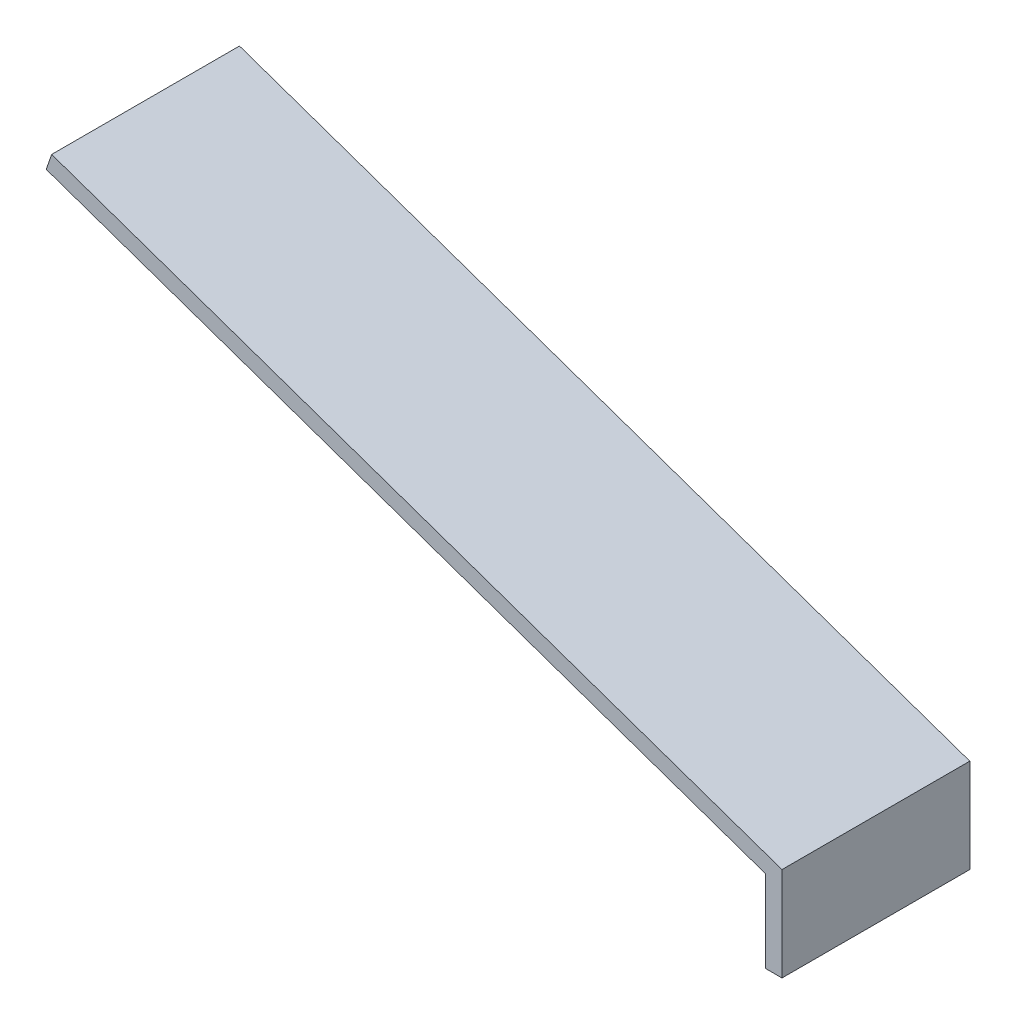
ISO-10303-21;
HEADER;
FILE_DESCRIPTION(('STEP AP214'),'2;1');
FILE_NAME('part.step','',(''),(''),'','','');
FILE_SCHEMA(('AUTOMOTIVE_DESIGN { 1 0 10303 214 1 1 1 1 }'));
ENDSEC;
DATA;
#1=APPLICATION_CONTEXT('core data for automotive mechanical design processes');
#2=APPLICATION_PROTOCOL_DEFINITION('international standard','automotive_design',2000,#1);
#3=PRODUCT_CONTEXT('',#1,'mechanical');
#4=PRODUCT('Part','Part','',(#3));
#5=PRODUCT_RELATED_PRODUCT_CATEGORY('part','',(#4));
#6=PRODUCT_DEFINITION_FORMATION('','',#4);
#7=PRODUCT_DEFINITION_CONTEXT('part definition',#1,'design');
#8=PRODUCT_DEFINITION('design','',#6,#7);
#9=PRODUCT_DEFINITION_SHAPE('','',#8);
#10=(LENGTH_UNIT() NAMED_UNIT(*) SI_UNIT(.MILLI.,.METRE.));
#11=(NAMED_UNIT(*) PLANE_ANGLE_UNIT() SI_UNIT($,.RADIAN.));
#12=(NAMED_UNIT(*) SI_UNIT($,.STERADIAN.) SOLID_ANGLE_UNIT());
#13=UNCERTAINTY_MEASURE_WITH_UNIT(LENGTH_MEASURE(1.E-05),#10,'distance_accuracy_value','');
#14=(GEOMETRIC_REPRESENTATION_CONTEXT(3) GLOBAL_UNCERTAINTY_ASSIGNED_CONTEXT((#13)) GLOBAL_UNIT_ASSIGNED_CONTEXT((#10,
#11,#12)) REPRESENTATION_CONTEXT('',''));
#15=CARTESIAN_POINT('',(0.,0.,0.));
#16=DIRECTION('',(0.,0.,1.));
#17=DIRECTION('',(1.,0.,0.));
#18=AXIS2_PLACEMENT_3D('',#15,#16,#17);
#19=CARTESIAN_POINT('',(0.,0.,2.1));
#20=DIRECTION('',(0.,-1.,0.));
#21=DIRECTION('',(0.,0.,-1.));
#22=AXIS2_PLACEMENT_3D('',#19,#20,#21);
#23=PLANE('',#22);
#24=DIRECTION('',(-1.,0.,0.));
#25=VECTOR('',#24,1.);
#26=CARTESIAN_POINT('',(0.,0.,-1.7000000000001));
#27=LINE('',#26,#25);
#28=CARTESIAN_POINT('',(0.300000000000014,0.,-1.7000000000001));
#29=VERTEX_POINT('',#28);
#30=CARTESIAN_POINT('',(0.,0.,-1.7000000000001));
#31=VERTEX_POINT('',#30);
#32=EDGE_CURVE('E29',#29,#31,#27,.T.);
#33=ORIENTED_EDGE('',*,*,#32,.F.);
#34=DIRECTION('',(0.,0.,-1.));
#35=VECTOR('',#34,1.);
#36=CARTESIAN_POINT('',(0.299999999999986,0.,2.1));
#37=LINE('',#36,#35);
#38=CARTESIAN_POINT('',(0.300000000000014,0.,1.69999999999989));
#39=VERTEX_POINT('',#38);
#40=EDGE_CURVE('E95',#39,#29,#37,.T.);
#41=ORIENTED_EDGE('',*,*,#40,.F.);
#42=DIRECTION('',(1.,0.,0.));
#43=VECTOR('',#42,1.);
#44=CARTESIAN_POINT('',(0.,0.,1.69999999999989));
#45=LINE('',#44,#43);
#46=CARTESIAN_POINT('',(0.,0.,1.69999999999989));
#47=VERTEX_POINT('',#46);
#48=EDGE_CURVE('E108',#47,#39,#45,.T.);
#49=ORIENTED_EDGE('',*,*,#48,.F.);
#50=DIRECTION('',(0.,0.,-1.));
#51=VECTOR('',#50,1.);
#52=CARTESIAN_POINT('',(0.,0.,2.1));
#53=LINE('',#52,#51);
#54=EDGE_CURVE('E89',#47,#31,#53,.T.);
#55=ORIENTED_EDGE('',*,*,#54,.T.);
#56=EDGE_LOOP('',(#33,#41,#49,#55));
#57=FACE_BOUND('',#56,.T.);
#58=ADVANCED_FACE('F16',(#57),#23,.T.);
#59=CARTESIAN_POINT('',(0.299999999999986,1.7,2.1));
#60=DIRECTION('',(1.,0.,0.));
#61=DIRECTION('',(0.,0.,-1.));
#62=AXIS2_PLACEMENT_3D('',#59,#60,#61);
#63=PLANE('',#62);
#64=DIRECTION('',(0.,-1.,0.));
#65=VECTOR('',#64,1.);
#66=CARTESIAN_POINT('',(0.300000000000012,1.7,-1.7000000000001));
#67=LINE('',#66,#65);
#68=CARTESIAN_POINT('',(0.300000000000012,1.7,-1.7000000000001));
#69=VERTEX_POINT('',#68);
#70=EDGE_CURVE('E115',#69,#29,#67,.T.);
#71=ORIENTED_EDGE('',*,*,#70,.F.);
#72=DIRECTION('',(0.,0.,-1.));
#73=VECTOR('',#72,1.);
#74=CARTESIAN_POINT('',(0.299999999999986,1.7,2.1));
#75=LINE('',#74,#73);
#76=CARTESIAN_POINT('',(0.299999999999988,1.7,1.6999999999999));
#77=VERTEX_POINT('',#76);
#78=EDGE_CURVE('E87',#77,#69,#75,.T.);
#79=ORIENTED_EDGE('',*,*,#78,.F.);
#80=DIRECTION('',(0.,1.,0.));
#81=VECTOR('',#80,1.);
#82=CARTESIAN_POINT('',(0.299999999999988,1.7,1.6999999999999));
#83=LINE('',#82,#81);
#84=EDGE_CURVE('E106',#39,#77,#83,.T.);
#85=ORIENTED_EDGE('',*,*,#84,.F.);
#86=ORIENTED_EDGE('',*,*,#40,.T.);
#87=EDGE_LOOP('',(#71,#79,#85,#86));
#88=FACE_BOUND('',#87,.T.);
#89=ADVANCED_FACE('F132',(#88),#63,.T.);
#90=CARTESIAN_POINT('',(-12.9220725547592,6.30182543744157,2.09999999999991));
#91=DIRECTION('',(0.328701816960112,0.944433753911369,0.));
#92=DIRECTION('',(-0.944433753911369,0.328701816960112,0.));
#93=AXIS2_PLACEMENT_3D('',#90,#91,#92);
#94=PLANE('',#93);
#95=DIRECTION('',(0.944433753911369,-0.328701816960112,0.));
#96=VECTOR('',#95,1.);
#97=CARTESIAN_POINT('',(-12.9220725547592,6.30182543744158,-1.70000000000009));
#98=LINE('',#97,#96);
#99=CARTESIAN_POINT('',(-12.9220725547592,6.30182543744158,-1.70000000000009));
#100=VERTEX_POINT('',#99);
#101=EDGE_CURVE('E113',#100,#69,#98,.T.);
#102=ORIENTED_EDGE('',*,*,#101,.F.);
#103=DIRECTION('',(0.,0.,-1.));
#104=VECTOR('',#103,1.);
#105=CARTESIAN_POINT('',(-12.9220725547592,6.30182543744157,2.09999999999991));
#106=LINE('',#105,#104);
#107=CARTESIAN_POINT('',(-12.9220725547592,6.30182543744157,1.69999999999991));
#108=VERTEX_POINT('',#107);
#109=EDGE_CURVE('E82',#108,#100,#106,.T.);
#110=ORIENTED_EDGE('',*,*,#109,.F.);
#111=DIRECTION('',(-0.944433753911369,0.328701816960112,0.));
#112=VECTOR('',#111,1.);
#113=CARTESIAN_POINT('',(-12.9220725547592,6.30182543744157,1.69999999999991));
#114=LINE('',#113,#112);
#115=EDGE_CURVE('E94',#77,#108,#114,.T.);
#116=ORIENTED_EDGE('',*,*,#115,.F.);
#117=ORIENTED_EDGE('',*,*,#78,.T.);
#118=EDGE_LOOP('',(#102,#110,#116,#117));
#119=FACE_BOUND('',#118,.T.);
#120=ADVANCED_FACE('F136',(#119),#94,.T.);
#121=CARTESIAN_POINT('',(-13.0206830998472,6.01849531126816,2.09999999999991));
#122=DIRECTION('',(-0.944433753911369,0.328701816960113,0.));
#123=DIRECTION('',(-0.328701816960113,-0.944433753911369,0.));
#124=AXIS2_PLACEMENT_3D('',#121,#122,#123);
#125=PLANE('',#124);
#126=DIRECTION('',(0.328701816960112,0.944433753911369,0.));
#127=VECTOR('',#126,1.);
#128=CARTESIAN_POINT('',(-16.7678838131925,-4.74804948332144,-1.70000000000011));
#129=LINE('',#128,#127);
#130=CARTESIAN_POINT('',(-13.0206830998472,6.01849531126817,-1.70000000000009));
#131=VERTEX_POINT('',#130);
#132=EDGE_CURVE('E68',#131,#100,#129,.T.);
#133=ORIENTED_EDGE('',*,*,#132,.F.);
#134=DIRECTION('',(0.,0.,-1.));
#135=VECTOR('',#134,1.);
#136=CARTESIAN_POINT('',(-13.0206830998472,6.01849531126816,2.09999999999991));
#137=LINE('',#136,#135);
#138=CARTESIAN_POINT('',(-13.0206830998472,6.01849531126816,1.69999999999991));
#139=VERTEX_POINT('',#138);
#140=EDGE_CURVE('E80',#139,#131,#137,.T.);
#141=ORIENTED_EDGE('',*,*,#140,.F.);
#142=DIRECTION('',(0.328701816960112,0.944433753911369,0.));
#143=VECTOR('',#142,1.);
#144=CARTESIAN_POINT('',(-16.7678838131925,-4.74804948332145,1.69999999999988));
#145=LINE('',#144,#143);
#146=EDGE_CURVE('E111',#139,#108,#145,.T.);
#147=ORIENTED_EDGE('',*,*,#146,.T.);
#148=ORIENTED_EDGE('',*,*,#109,.T.);
#149=EDGE_LOOP('',(#133,#141,#147,#148));
#150=FACE_BOUND('',#149,.T.);
#151=ADVANCED_FACE('F78',(#150),#125,.T.);
#152=CARTESIAN_POINT('',(0.,1.48676169283667,2.1));
#153=DIRECTION('',(-0.328701816960112,-0.944433753911369,0.));
#154=DIRECTION('',(0.944433753911369,-0.328701816960112,0.));
#155=AXIS2_PLACEMENT_3D('',#152,#153,#154);
#156=PLANE('',#155);
#157=DIRECTION('',(-0.944433753911369,0.328701816960112,0.));
#158=VECTOR('',#157,1.);
#159=CARTESIAN_POINT('',(0.,1.48676169283668,-1.7000000000001));
#160=LINE('',#159,#158);
#161=CARTESIAN_POINT('',(0.,1.48676169283667,-1.7000000000001));
#162=VERTEX_POINT('',#161);
#163=EDGE_CURVE('E65',#162,#131,#160,.T.);
#164=ORIENTED_EDGE('',*,*,#163,.F.);
#165=DIRECTION('',(0.,0.,-1.));
#166=VECTOR('',#165,1.);
#167=CARTESIAN_POINT('',(0.,1.48676169283667,2.1));
#168=LINE('',#167,#166);
#169=CARTESIAN_POINT('',(0.,1.48676169283667,1.6999999999999));
#170=VERTEX_POINT('',#169);
#171=EDGE_CURVE('E85',#170,#162,#168,.T.);
#172=ORIENTED_EDGE('',*,*,#171,.F.);
#173=DIRECTION('',(0.944433753911369,-0.328701816960112,0.));
#174=VECTOR('',#173,1.);
#175=CARTESIAN_POINT('',(0.,1.48676169283667,1.6999999999999));
#176=LINE('',#175,#174);
#177=EDGE_CURVE('E37',#139,#170,#176,.T.);
#178=ORIENTED_EDGE('',*,*,#177,.F.);
#179=ORIENTED_EDGE('',*,*,#140,.T.);
#180=EDGE_LOOP('',(#164,#172,#178,#179));
#181=FACE_BOUND('',#180,.T.);
#182=ADVANCED_FACE('F84',(#181),#156,.T.);
#183=CARTESIAN_POINT('',(0.,1.48676169283667,2.1));
#184=DIRECTION('',(-1.,0.,0.));
#185=DIRECTION('',(0.,0.,1.));
#186=AXIS2_PLACEMENT_3D('',#183,#184,#185);
#187=PLANE('',#186);
#188=DIRECTION('',(0.,1.,0.));
#189=VECTOR('',#188,1.);
#190=CARTESIAN_POINT('',(0.,1.48676169283668,-1.7000000000001));
#191=LINE('',#190,#189);
#192=EDGE_CURVE('E11',#31,#162,#191,.T.);
#193=ORIENTED_EDGE('',*,*,#192,.F.);
#194=ORIENTED_EDGE('',*,*,#54,.F.);
#195=DIRECTION('',(0.,-1.,0.));
#196=VECTOR('',#195,1.);
#197=CARTESIAN_POINT('',(0.,1.48676169283667,1.6999999999999));
#198=LINE('',#197,#196);
#199=EDGE_CURVE('E23',#170,#47,#198,.T.);
#200=ORIENTED_EDGE('',*,*,#199,.F.);
#201=ORIENTED_EDGE('',*,*,#171,.T.);
#202=EDGE_LOOP('',(#193,#194,#200,#201));
#203=FACE_BOUND('',#202,.T.);
#204=ADVANCED_FACE('F121',(#203),#187,.T.);
#205=CARTESIAN_POINT('',(-16.7678838131925,-4.74804948332145,1.69999999999988));
#206=DIRECTION('',(0.,0.,-1.));
#207=DIRECTION('',(0.,1.,0.));
#208=AXIS2_PLACEMENT_3D('',#205,#206,#207);
#209=PLANE('',#208);
#210=ORIENTED_EDGE('',*,*,#115,.T.);
#211=ORIENTED_EDGE('',*,*,#146,.F.);
#212=ORIENTED_EDGE('',*,*,#177,.T.);
#213=ORIENTED_EDGE('',*,*,#199,.T.);
#214=ORIENTED_EDGE('',*,*,#48,.T.);
#215=ORIENTED_EDGE('',*,*,#84,.T.);
#216=EDGE_LOOP('',(#210,#211,#212,#213,#214,#215));
#217=FACE_BOUND('',#216,.T.);
#218=ADVANCED_FACE('F123',(#217),#209,.F.);
#219=CARTESIAN_POINT('',(-16.7678838131925,-4.74804948332144,-1.70000000000011));
#220=DIRECTION('',(0.,0.,1.));
#221=DIRECTION('',(0.,-1.,0.));
#222=AXIS2_PLACEMENT_3D('',#219,#220,#221);
#223=PLANE('',#222);
#224=ORIENTED_EDGE('',*,*,#101,.T.);
#225=ORIENTED_EDGE('',*,*,#70,.T.);
#226=ORIENTED_EDGE('',*,*,#32,.T.);
#227=ORIENTED_EDGE('',*,*,#192,.T.);
#228=ORIENTED_EDGE('',*,*,#163,.T.);
#229=ORIENTED_EDGE('',*,*,#132,.T.);
#230=EDGE_LOOP('',(#224,#225,#226,#227,#228,#229));
#231=FACE_BOUND('',#230,.T.);
#232=ADVANCED_FACE('F67',(#231),#223,.F.);
#233=CLOSED_SHELL('',(#58,#89,#120,#151,#182,#204,#218,#232));
#234=MANIFOLD_SOLID_BREP('B1',#233);
#235=ADVANCED_BREP_SHAPE_REPRESENTATION('',(#18,#234),#14);
#236=SHAPE_DEFINITION_REPRESENTATION(#9,#235);
ENDSEC;
END-ISO-10303-21;
